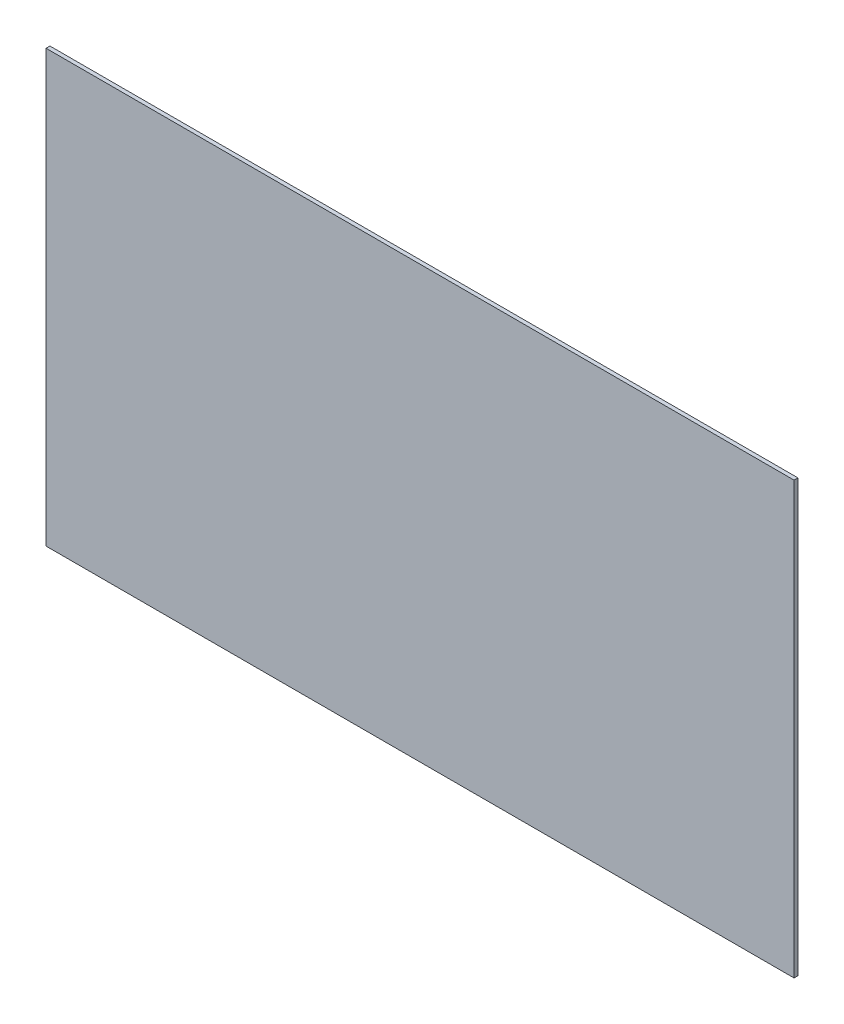
ISO-10303-21;
HEADER;
FILE_DESCRIPTION(('STEP AP214'),'2;1');
FILE_NAME('part.step','',(''),(''),'','','');
FILE_SCHEMA(('AUTOMOTIVE_DESIGN { 1 0 10303 214 1 1 1 1 }'));
ENDSEC;
DATA;
#1=APPLICATION_CONTEXT('core data for automotive mechanical design processes');
#2=APPLICATION_PROTOCOL_DEFINITION('international standard','automotive_design',2000,#1);
#3=PRODUCT_CONTEXT('',#1,'mechanical');
#4=PRODUCT('Part','Part','',(#3));
#5=PRODUCT_RELATED_PRODUCT_CATEGORY('part','',(#4));
#6=PRODUCT_DEFINITION_FORMATION('','',#4);
#7=PRODUCT_DEFINITION_CONTEXT('part definition',#1,'design');
#8=PRODUCT_DEFINITION('design','',#6,#7);
#9=PRODUCT_DEFINITION_SHAPE('','',#8);
#10=(LENGTH_UNIT() NAMED_UNIT(*) SI_UNIT(.MILLI.,.METRE.));
#11=(NAMED_UNIT(*) PLANE_ANGLE_UNIT() SI_UNIT($,.RADIAN.));
#12=(NAMED_UNIT(*) SI_UNIT($,.STERADIAN.) SOLID_ANGLE_UNIT());
#13=UNCERTAINTY_MEASURE_WITH_UNIT(LENGTH_MEASURE(1.E-05),#10,'distance_accuracy_value','');
#14=(GEOMETRIC_REPRESENTATION_CONTEXT(3) GLOBAL_UNCERTAINTY_ASSIGNED_CONTEXT((#13)) GLOBAL_UNIT_ASSIGNED_CONTEXT((#10,
#11,#12)) REPRESENTATION_CONTEXT('',''));
#15=CARTESIAN_POINT('',(0.,0.,0.));
#16=DIRECTION('',(0.,0.,1.));
#17=DIRECTION('',(1.,0.,0.));
#18=AXIS2_PLACEMENT_3D('',#15,#16,#17);
#19=CARTESIAN_POINT('',(0.,0.,9.525));
#20=DIRECTION('',(1.,0.,0.));
#21=DIRECTION('',(0.,0.,-1.));
#22=AXIS2_PLACEMENT_3D('',#19,#20,#21);
#23=PLANE('',#22);
#24=DIRECTION('',(0.,-1.,0.));
#25=VECTOR('',#24,1.);
#26=CARTESIAN_POINT('',(0.,0.,0.));
#27=LINE('',#26,#25);
#28=CARTESIAN_POINT('',(0.,1054.1,0.));
#29=VERTEX_POINT('',#28);
#30=CARTESIAN_POINT('',(0.,0.,0.));
#31=VERTEX_POINT('',#30);
#32=EDGE_CURVE('E96',#29,#31,#27,.T.);
#33=ORIENTED_EDGE('',*,*,#32,.T.);
#34=DIRECTION('',(0.,0.,-1.));
#35=VECTOR('',#34,1.);
#36=CARTESIAN_POINT('',(0.,0.,9.525));
#37=LINE('',#36,#35);
#38=CARTESIAN_POINT('',(0.,0.,9.525));
#39=VERTEX_POINT('',#38);
#40=EDGE_CURVE('E11',#39,#31,#37,.T.);
#41=ORIENTED_EDGE('',*,*,#40,.F.);
#42=DIRECTION('',(0.,-1.,0.));
#43=VECTOR('',#42,1.);
#44=CARTESIAN_POINT('',(0.,0.,9.525));
#45=LINE('',#44,#43);
#46=CARTESIAN_POINT('',(0.,1054.1,9.525));
#47=VERTEX_POINT('',#46);
#48=EDGE_CURVE('E84',#47,#39,#45,.T.);
#49=ORIENTED_EDGE('',*,*,#48,.F.);
#50=DIRECTION('',(0.,0.,-1.));
#51=VECTOR('',#50,1.);
#52=CARTESIAN_POINT('',(0.,1054.1,9.525));
#53=LINE('',#52,#51);
#54=EDGE_CURVE('E92',#47,#29,#53,.T.);
#55=ORIENTED_EDGE('',*,*,#54,.T.);
#56=EDGE_LOOP('',(#33,#41,#49,#55));
#57=FACE_BOUND('',#56,.T.);
#58=ADVANCED_FACE('F33',(#57),#23,.F.);
#59=CARTESIAN_POINT('',(0.,0.,9.525));
#60=DIRECTION('',(0.,1.,0.));
#61=DIRECTION('',(0.,0.,1.));
#62=AXIS2_PLACEMENT_3D('',#59,#60,#61);
#63=PLANE('',#62);
#64=DIRECTION('',(1.,0.,0.));
#65=VECTOR('',#64,1.);
#66=CARTESIAN_POINT('',(0.,0.,0.));
#67=LINE('',#66,#65);
#68=CARTESIAN_POINT('',(1828.8,0.,0.));
#69=VERTEX_POINT('',#68);
#70=EDGE_CURVE('E88',#31,#69,#67,.T.);
#71=ORIENTED_EDGE('',*,*,#70,.T.);
#72=DIRECTION('',(0.,0.,-1.));
#73=VECTOR('',#72,1.);
#74=CARTESIAN_POINT('',(1828.8,0.,9.525));
#75=LINE('',#74,#73);
#76=CARTESIAN_POINT('',(1828.8,0.,9.525));
#77=VERTEX_POINT('',#76);
#78=EDGE_CURVE('E41',#77,#69,#75,.T.);
#79=ORIENTED_EDGE('',*,*,#78,.F.);
#80=DIRECTION('',(1.,0.,0.));
#81=VECTOR('',#80,1.);
#82=CARTESIAN_POINT('',(0.,0.,9.525));
#83=LINE('',#82,#81);
#84=EDGE_CURVE('E79',#39,#77,#83,.T.);
#85=ORIENTED_EDGE('',*,*,#84,.F.);
#86=ORIENTED_EDGE('',*,*,#40,.T.);
#87=EDGE_LOOP('',(#71,#79,#85,#86));
#88=FACE_BOUND('',#87,.T.);
#89=ADVANCED_FACE('F87',(#88),#63,.F.);
#90=CARTESIAN_POINT('',(1828.8,0.,9.525));
#91=DIRECTION('',(-1.,0.,0.));
#92=DIRECTION('',(0.,0.,1.));
#93=AXIS2_PLACEMENT_3D('',#90,#91,#92);
#94=PLANE('',#93);
#95=DIRECTION('',(0.,1.,0.));
#96=VECTOR('',#95,1.);
#97=CARTESIAN_POINT('',(1828.8,0.,0.));
#98=LINE('',#97,#96);
#99=CARTESIAN_POINT('',(1828.8,1054.1,0.));
#100=VERTEX_POINT('',#99);
#101=EDGE_CURVE('E66',#69,#100,#98,.T.);
#102=ORIENTED_EDGE('',*,*,#101,.T.);
#103=DIRECTION('',(0.,0.,-1.));
#104=VECTOR('',#103,1.);
#105=CARTESIAN_POINT('',(1828.8,1054.1,9.525));
#106=LINE('',#105,#104);
#107=CARTESIAN_POINT('',(1828.8,1054.1,9.525));
#108=VERTEX_POINT('',#107);
#109=EDGE_CURVE('E89',#108,#100,#106,.T.);
#110=ORIENTED_EDGE('',*,*,#109,.F.);
#111=DIRECTION('',(0.,1.,0.));
#112=VECTOR('',#111,1.);
#113=CARTESIAN_POINT('',(1828.8,0.,9.525));
#114=LINE('',#113,#112);
#115=EDGE_CURVE('E82',#77,#108,#114,.T.);
#116=ORIENTED_EDGE('',*,*,#115,.F.);
#117=ORIENTED_EDGE('',*,*,#78,.T.);
#118=EDGE_LOOP('',(#102,#110,#116,#117));
#119=FACE_BOUND('',#118,.T.);
#120=ADVANCED_FACE('F90',(#119),#94,.F.);
#121=CARTESIAN_POINT('',(0.,1054.1,9.525));
#122=DIRECTION('',(0.,-1.,0.));
#123=DIRECTION('',(0.,0.,-1.));
#124=AXIS2_PLACEMENT_3D('',#121,#122,#123);
#125=PLANE('',#124);
#126=DIRECTION('',(-1.,0.,0.));
#127=VECTOR('',#126,1.);
#128=CARTESIAN_POINT('',(0.,1054.1,0.));
#129=LINE('',#128,#127);
#130=EDGE_CURVE('E72',#100,#29,#129,.T.);
#131=ORIENTED_EDGE('',*,*,#130,.T.);
#132=ORIENTED_EDGE('',*,*,#54,.F.);
#133=DIRECTION('',(-1.,0.,0.));
#134=VECTOR('',#133,1.);
#135=CARTESIAN_POINT('',(0.,1054.1,9.525));
#136=LINE('',#135,#134);
#137=EDGE_CURVE('E49',#108,#47,#136,.T.);
#138=ORIENTED_EDGE('',*,*,#137,.F.);
#139=ORIENTED_EDGE('',*,*,#109,.T.);
#140=EDGE_LOOP('',(#131,#132,#138,#139));
#141=FACE_BOUND('',#140,.T.);
#142=ADVANCED_FACE('F103',(#141),#125,.F.);
#143=CARTESIAN_POINT('',(0.,0.,9.525));
#144=DIRECTION('',(0.,0.,-1.));
#145=DIRECTION('',(-1.,0.,0.));
#146=AXIS2_PLACEMENT_3D('',#143,#144,#145);
#147=PLANE('',#146);
#148=ORIENTED_EDGE('',*,*,#48,.T.);
#149=ORIENTED_EDGE('',*,*,#84,.T.);
#150=ORIENTED_EDGE('',*,*,#115,.T.);
#151=ORIENTED_EDGE('',*,*,#137,.T.);
#152=EDGE_LOOP('',(#148,#149,#150,#151));
#153=FACE_BOUND('',#152,.T.);
#154=ADVANCED_FACE('F80',(#153),#147,.F.);
#155=CARTESIAN_POINT('',(0.,0.,0.));
#156=DIRECTION('',(0.,0.,-1.));
#157=DIRECTION('',(-1.,0.,0.));
#158=AXIS2_PLACEMENT_3D('',#155,#156,#157);
#159=PLANE('',#158);
#160=ORIENTED_EDGE('',*,*,#32,.F.);
#161=ORIENTED_EDGE('',*,*,#130,.F.);
#162=ORIENTED_EDGE('',*,*,#101,.F.);
#163=ORIENTED_EDGE('',*,*,#70,.F.);
#164=EDGE_LOOP('',(#160,#161,#162,#163));
#165=FACE_BOUND('',#164,.T.);
#166=ADVANCED_FACE('F106',(#165),#159,.T.);
#167=CLOSED_SHELL('',(#58,#89,#120,#142,#154,#166));
#168=MANIFOLD_SOLID_BREP('B2',#167);
#169=ADVANCED_BREP_SHAPE_REPRESENTATION('',(#18,#168),#14);
#170=SHAPE_DEFINITION_REPRESENTATION(#9,#169);
ENDSEC;
END-ISO-10303-21;
